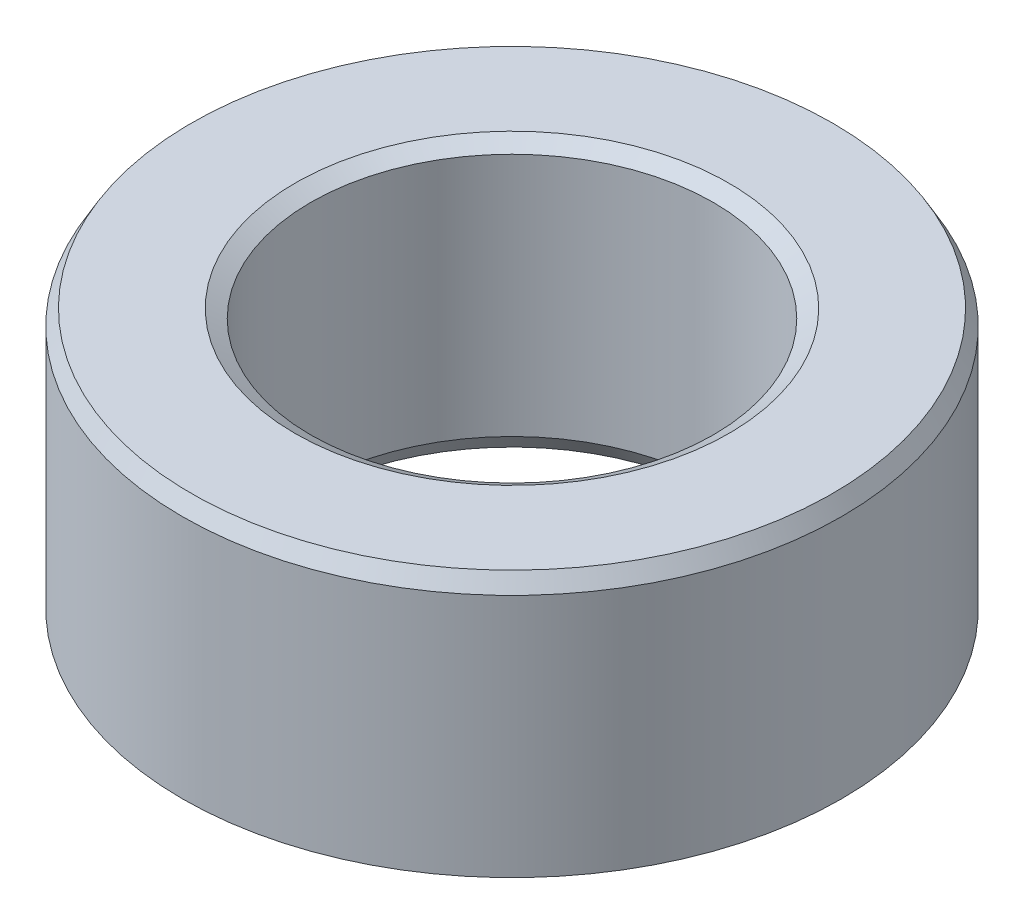
ISO-10303-21;
HEADER;
FILE_DESCRIPTION(('STEP AP214'),'2;1');
FILE_NAME('part.step','',(''),(''),'','','');
FILE_SCHEMA(('AUTOMOTIVE_DESIGN { 1 0 10303 214 1 1 1 1 }'));
ENDSEC;
DATA;
#1=APPLICATION_CONTEXT('core data for automotive mechanical design processes');
#2=APPLICATION_PROTOCOL_DEFINITION('international standard','automotive_design',2000,#1);
#3=PRODUCT_CONTEXT('',#1,'mechanical');
#4=PRODUCT('Part','Part','',(#3));
#5=PRODUCT_RELATED_PRODUCT_CATEGORY('part','',(#4));
#6=PRODUCT_DEFINITION_FORMATION('','',#4);
#7=PRODUCT_DEFINITION_CONTEXT('part definition',#1,'design');
#8=PRODUCT_DEFINITION('design','',#6,#7);
#9=PRODUCT_DEFINITION_SHAPE('','',#8);
#10=(LENGTH_UNIT() NAMED_UNIT(*) SI_UNIT(.MILLI.,.METRE.));
#11=(NAMED_UNIT(*) PLANE_ANGLE_UNIT() SI_UNIT($,.RADIAN.));
#12=(NAMED_UNIT(*) SI_UNIT($,.STERADIAN.) SOLID_ANGLE_UNIT());
#13=UNCERTAINTY_MEASURE_WITH_UNIT(LENGTH_MEASURE(1.E-05),#10,'distance_accuracy_value','');
#14=(GEOMETRIC_REPRESENTATION_CONTEXT(3) GLOBAL_UNCERTAINTY_ASSIGNED_CONTEXT((#13)) GLOBAL_UNIT_ASSIGNED_CONTEXT((#10,
#11,#12)) REPRESENTATION_CONTEXT('',''));
#15=CARTESIAN_POINT('',(0.,0.,0.));
#16=DIRECTION('',(0.,0.,1.));
#17=DIRECTION('',(1.,0.,0.));
#18=AXIS2_PLACEMENT_3D('',#15,#16,#17);
#19=CARTESIAN_POINT('',(0.,46.9005576130169,0.));
#20=DIRECTION('',(0.,-1.,0.));
#21=DIRECTION('',(0.,0.,-1.));
#22=AXIS2_PLACEMENT_3D('',#19,#20,#21);
#23=CYLINDRICAL_SURFACE('',#22,57.5);
#24=CARTESIAN_POINT('',(0.,1.56411601894434,0.));
#25=DIRECTION('',(0.,1.,0.));
#26=DIRECTION('',(0.,0.,1.));
#27=AXIS2_PLACEMENT_3D('',#24,#25,#26);
#28=CIRCLE('',#27,57.5);
#29=CARTESIAN_POINT('',(0.,1.56411601894434,57.5));
#30=VERTEX_POINT('',#29);
#31=EDGE_CURVE('E10',#30,#30,#28,.T.);
#32=ORIENTED_EDGE('',*,*,#31,.T.);
#33=EDGE_LOOP('',(#32));
#34=FACE_BOUND('',#33,.T.);
#35=CARTESIAN_POINT('',(0.,44.191429199273,0.));
#36=DIRECTION('',(0.,1.,0.));
#37=DIRECTION('',(0.,0.,1.));
#38=AXIS2_PLACEMENT_3D('',#35,#36,#37);
#39=CIRCLE('',#38,57.5);
#40=CARTESIAN_POINT('',(0.,44.191429199273,-57.5));
#41=VERTEX_POINT('',#40);
#42=EDGE_CURVE('E50',#41,#41,#39,.F.);
#43=ORIENTED_EDGE('',*,*,#42,.T.);
#44=EDGE_LOOP('',(#43));
#45=FACE_BOUND('',#44,.T.);
#46=ADVANCED_FACE('F39',(#34,#45),#23,.T.);
#47=CARTESIAN_POINT('',(0.,46.9005576130169,0.));
#48=DIRECTION('',(0.,1.,0.));
#49=DIRECTION('',(0.,0.,1.));
#50=AXIS2_PLACEMENT_3D('',#47,#48,#49);
#51=PLANE('',#50);
#52=CARTESIAN_POINT('',(0.,46.9005576130169,0.));
#53=DIRECTION('',(0.,1.,0.));
#54=DIRECTION('',(0.,0.,1.));
#55=AXIS2_PLACEMENT_3D('',#52,#53,#54);
#56=CIRCLE('',#55,37.8292583250053);
#57=CARTESIAN_POINT('',(0.,46.9005576130169,37.8292583250053));
#58=VERTEX_POINT('',#57);
#59=EDGE_CURVE('E58',#58,#58,#56,.F.);
#60=ORIENTED_EDGE('',*,*,#59,.T.);
#61=EDGE_LOOP('',(#60));
#62=FACE_BOUND('',#61,.T.);
#63=CARTESIAN_POINT('',(0.,46.9005576130169,0.));
#64=DIRECTION('',(0.,1.,0.));
#65=DIRECTION('',(0.,0.,1.));
#66=AXIS2_PLACEMENT_3D('',#63,#64,#65);
#67=CIRCLE('',#66,55.9358839810557);
#68=CARTESIAN_POINT('',(0.,46.9005576130169,-55.9358839810557));
#69=VERTEX_POINT('',#68);
#70=EDGE_CURVE('E61',#69,#69,#67,.T.);
#71=ORIENTED_EDGE('',*,*,#70,.T.);
#72=EDGE_LOOP('',(#71));
#73=FACE_BOUND('',#72,.T.);
#74=ADVANCED_FACE('F88',(#62,#73),#51,.T.);
#75=CARTESIAN_POINT('',(0.,0.,0.));
#76=DIRECTION('',(0.,1.,0.));
#77=DIRECTION('',(0.,0.,1.));
#78=AXIS2_PLACEMENT_3D('',#75,#76,#77);
#79=PLANE('',#78);
#80=CARTESIAN_POINT('',(0.,0.,0.));
#81=DIRECTION('',(0.,1.,0.));
#82=DIRECTION('',(0.,0.,1.));
#83=AXIS2_PLACEMENT_3D('',#80,#81,#82);
#84=CIRCLE('',#83,36.6842459302058);
#85=CARTESIAN_POINT('',(0.,0.,36.6842459302058));
#86=VERTEX_POINT('',#85);
#87=EDGE_CURVE('E51',#86,#86,#84,.T.);
#88=ORIENTED_EDGE('',*,*,#87,.T.);
#89=EDGE_LOOP('',(#88));
#90=FACE_BOUND('',#89,.T.);
#91=CARTESIAN_POINT('',(0.,0.,0.));
#92=DIRECTION('',(0.,1.,0.));
#93=DIRECTION('',(0.,0.,1.));
#94=AXIS2_PLACEMENT_3D('',#91,#92,#93);
#95=CIRCLE('',#94,54.790871586256);
#96=CARTESIAN_POINT('',(0.,0.,54.790871586256));
#97=VERTEX_POINT('',#96);
#98=EDGE_CURVE('E54',#97,#97,#95,.F.);
#99=ORIENTED_EDGE('',*,*,#98,.T.);
#100=EDGE_LOOP('',(#99));
#101=FACE_BOUND('',#100,.T.);
#102=ADVANCED_FACE('F83',(#90,#101),#79,.F.);
#103=CARTESIAN_POINT('',(0.,46.9005576130169,0.));
#104=DIRECTION('',(0.,-1.,0.));
#105=DIRECTION('',(0.,0.,-1.));
#106=AXIS2_PLACEMENT_3D('',#103,#104,#105);
#107=CYLINDRICAL_SURFACE('',#106,35.1201299112614);
#108=CARTESIAN_POINT('',(0.,45.3364415940726,0.));
#109=DIRECTION('',(0.,1.,0.));
#110=DIRECTION('',(0.,0.,1.));
#111=AXIS2_PLACEMENT_3D('',#108,#109,#110);
#112=CIRCLE('',#111,35.1201299112614);
#113=CARTESIAN_POINT('',(0.,45.3364415940726,35.1201299112614));
#114=VERTEX_POINT('',#113);
#115=EDGE_CURVE('E67',#114,#114,#112,.T.);
#116=ORIENTED_EDGE('',*,*,#115,.T.);
#117=EDGE_LOOP('',(#116));
#118=FACE_BOUND('',#117,.T.);
#119=CARTESIAN_POINT('',(0.,2.70912841374395,0.));
#120=DIRECTION('',(0.,1.,0.));
#121=DIRECTION('',(0.,0.,1.));
#122=AXIS2_PLACEMENT_3D('',#119,#120,#121);
#123=CIRCLE('',#122,35.1201299112614);
#124=CARTESIAN_POINT('',(0.,2.70912841374395,35.1201299112614));
#125=VERTEX_POINT('',#124);
#126=EDGE_CURVE('E69',#125,#125,#123,.F.);
#127=ORIENTED_EDGE('',*,*,#126,.T.);
#128=EDGE_LOOP('',(#127));
#129=FACE_BOUND('',#128,.T.);
#130=ADVANCED_FACE('F71',(#118,#129),#107,.F.);
#131=CARTESIAN_POINT('',(0.,45.3364415940726,0.));
#132=DIRECTION('',(0.,1.,0.));
#133=DIRECTION('',(0.,0.,1.));
#134=AXIS2_PLACEMENT_3D('',#131,#132,#133);
#135=CONICAL_SURFACE('',#134,35.1201299112614,1.0471975511966);
#136=ORIENTED_EDGE('',*,*,#59,.F.);
#137=EDGE_LOOP('',(#136));
#138=FACE_BOUND('',#137,.T.);
#139=ORIENTED_EDGE('',*,*,#115,.F.);
#140=EDGE_LOOP('',(#139));
#141=FACE_BOUND('',#140,.T.);
#142=ADVANCED_FACE('F77',(#138,#141),#135,.F.);
#143=CARTESIAN_POINT('',(0.,0.,0.));
#144=DIRECTION('',(0.,-1.,0.));
#145=DIRECTION('',(0.,0.,-1.));
#146=AXIS2_PLACEMENT_3D('',#143,#144,#145);
#147=CONICAL_SURFACE('',#146,36.6842459302058,0.523598775598297);
#148=ORIENTED_EDGE('',*,*,#126,.F.);
#149=EDGE_LOOP('',(#148));
#150=FACE_BOUND('',#149,.T.);
#151=ORIENTED_EDGE('',*,*,#87,.F.);
#152=EDGE_LOOP('',(#151));
#153=FACE_BOUND('',#152,.T.);
#154=ADVANCED_FACE('F73',(#150,#153),#147,.F.);
#155=CARTESIAN_POINT('',(0.,1.56411601894434,0.));
#156=DIRECTION('',(0.,1.,0.));
#157=DIRECTION('',(0.,0.,1.));
#158=AXIS2_PLACEMENT_3D('',#155,#156,#157);
#159=CONICAL_SURFACE('',#158,57.5,1.0471975511966);
#160=ORIENTED_EDGE('',*,*,#98,.F.);
#161=EDGE_LOOP('',(#160));
#162=FACE_BOUND('',#161,.T.);
#163=ORIENTED_EDGE('',*,*,#31,.F.);
#164=EDGE_LOOP('',(#163));
#165=FACE_BOUND('',#164,.T.);
#166=ADVANCED_FACE('F76',(#162,#165),#159,.T.);
#167=CARTESIAN_POINT('',(0.,46.9005576130169,0.));
#168=DIRECTION('',(0.,-1.,0.));
#169=DIRECTION('',(0.,0.,-1.));
#170=AXIS2_PLACEMENT_3D('',#167,#168,#169);
#171=CONICAL_SURFACE('',#170,55.9358839810557,0.523598775598295);
#172=CARTESIAN_POINT('',(0.,44.191429199273,-57.5));
#173=CARTESIAN_POINT('',(0.,44.2196492869162,-57.4837071248027));
#174=CARTESIAN_POINT('',(0.,44.2478693745594,-57.4674142496053));
#175=CARTESIAN_POINT('',(0.,44.3043095498457,-57.4348284992107));
#176=CARTESIAN_POINT('',(0.,44.3325296374888,-57.4185356240133));
#177=CARTESIAN_POINT('',(0.,44.3889698127752,-57.3859498736186));
#178=CARTESIAN_POINT('',(0.,44.4171899004183,-57.3696569984213));
#179=CARTESIAN_POINT('',(0.,44.4736300757047,-57.3370712480266));
#180=CARTESIAN_POINT('',(0.,44.5018501633478,-57.3207783728293));
#181=CARTESIAN_POINT('',(0.,44.5582903386342,-57.2881926224346));
#182=CARTESIAN_POINT('',(0.,44.5865104262773,-57.2718997472373));
#183=CARTESIAN_POINT('',(0.,44.6429506015637,-57.2393139968426));
#184=CARTESIAN_POINT('',(0.,44.6711706892068,-57.2230211216453));
#185=CARTESIAN_POINT('',(0.,44.7276108644932,-57.1904353712506));
#186=CARTESIAN_POINT('',(0.,44.7558309521363,-57.1741424960533));
#187=CARTESIAN_POINT('',(0.,44.8122711274227,-57.1415567456586));
#188=CARTESIAN_POINT('',(0.,44.8404912150658,-57.1252638704613));
#189=CARTESIAN_POINT('',(0.,44.8969313903522,-57.0926781200666));
#190=CARTESIAN_POINT('',(0.,44.9251514779953,-57.0763852448693));
#191=CARTESIAN_POINT('',(0.,44.9815916532816,-57.0437994944746));
#192=CARTESIAN_POINT('',(0.,45.0098117409248,-57.0275066192773));
#193=CARTESIAN_POINT('',(0.,45.0662519162111,-56.9949208688826));
#194=CARTESIAN_POINT('',(0.,45.0944720038543,-56.9786279936853));
#195=CARTESIAN_POINT('',(0.,45.1509121791406,-56.9460422432906));
#196=CARTESIAN_POINT('',(0.,45.1791322667838,-56.9297493680932));
#197=CARTESIAN_POINT('',(0.,45.2355724420701,-56.8971636176986));
#198=CARTESIAN_POINT('',(0.,45.2637925297133,-56.8808707425012));
#199=CARTESIAN_POINT('',(0.,45.3202327049996,-56.8482849921066));
#200=CARTESIAN_POINT('',(0.,45.3484527926428,-56.8319921169092));
#201=CARTESIAN_POINT('',(0.,45.4048929679291,-56.7994063665146));
#202=CARTESIAN_POINT('',(0.,45.4331130555723,-56.7831134913172));
#203=CARTESIAN_POINT('',(0.,45.4895532308586,-56.7505277409225));
#204=CARTESIAN_POINT('',(0.,45.5177733185018,-56.7342348657252));
#205=CARTESIAN_POINT('',(0.,45.5742134937881,-56.7016491153305));
#206=CARTESIAN_POINT('',(0.,45.6024335814313,-56.6853562401332));
#207=CARTESIAN_POINT('',(0.,45.6588737567176,-56.6527704897385));
#208=CARTESIAN_POINT('',(0.,45.6870938443608,-56.6364776145412));
#209=CARTESIAN_POINT('',(0.,45.7435340196471,-56.6038918641465));
#210=CARTESIAN_POINT('',(0.,45.7717541072903,-56.5875989889492));
#211=CARTESIAN_POINT('',(0.,45.8281942825766,-56.5550132385545));
#212=CARTESIAN_POINT('',(0.,45.8564143702198,-56.5387203633572));
#213=CARTESIAN_POINT('',(0.,45.9128545455061,-56.5061346129625));
#214=CARTESIAN_POINT('',(0.,45.9410746331493,-56.4898417377652));
#215=CARTESIAN_POINT('',(0.,45.9975148084356,-56.4572559873705));
#216=CARTESIAN_POINT('',(0.,46.0257348960788,-56.4409631121732));
#217=CARTESIAN_POINT('',(0.,46.0821750713651,-56.4083773617785));
#218=CARTESIAN_POINT('',(0.,46.1103951590082,-56.3920844865812));
#219=CARTESIAN_POINT('',(0.,46.1668353342946,-56.3594987361865));
#220=CARTESIAN_POINT('',(0.,46.1950554219377,-56.3432058609892));
#221=CARTESIAN_POINT('',(0.,46.2514955972241,-56.3106201105945));
#222=CARTESIAN_POINT('',(0.,46.2797156848672,-56.2943272353971));
#223=CARTESIAN_POINT('',(0.,46.3361558601536,-56.2617414850025));
#224=CARTESIAN_POINT('',(0.,46.3643759477967,-56.2454486098051));
#225=CARTESIAN_POINT('',(0.,46.4208161230831,-56.2128628594105));
#226=CARTESIAN_POINT('',(0.,46.4490362107262,-56.1965699842131));
#227=CARTESIAN_POINT('',(0.,46.5054763860126,-56.1639842338184));
#228=CARTESIAN_POINT('',(0.,46.5336964736557,-56.1476913586211));
#229=CARTESIAN_POINT('',(0.,46.5901366489421,-56.1151056082265));
#230=CARTESIAN_POINT('',(0.,46.6183567365852,-56.0988127330291));
#231=CARTESIAN_POINT('',(0.,46.6747969118716,-56.0662269826344));
#232=CARTESIAN_POINT('',(0.,46.7030169995147,-56.0499341074371));
#233=CARTESIAN_POINT('',(0.,46.759457174801,-56.0173483570424));
#234=CARTESIAN_POINT('',(0.,46.7876772624442,-56.0010554818451));
#235=CARTESIAN_POINT('',(0.,46.8441174377305,-55.9684697314504));
#236=CARTESIAN_POINT('',(0.,46.8723375253737,-55.9521768562531));
#237=CARTESIAN_POINT('',(0.,46.9005576130169,-55.9358839810557));
#238=B_SPLINE_CURVE_WITH_KNOTS('',3,(#172,#173,#174,#175,#176,#177,#178,#179,#180,#181,#182,
#183,#184,#185,#186,#187,#188,#189,#190,#191,#192,#193,#194,#195,#196,#197,#198,#199,#200,#201,
#202,#203,#204,#205,#206,#207,#208,#209,#210,#211,#212,#213,#214,#215,#216,#217,#218,#219,#220,
#221,#222,#223,#224,#225,#226,#227,#228,#229,#230,#231,#232,#233,#234,#235,#236,#237),
.UNSPECIFIED.,.F.,.F.,(4,2,2,2,2,2,2,2,2,2,2,2,2,2,2,2,2,2,2,2,2,2,2,2,2,2,2,2,2,2,2,2,4),(0.,
0.0977572511840112,0.195514502368032,0.293271753552046,0.391029004736064,0.488786255920084,
0.586543507104095,0.684300758288116,0.782058009472133,0.879815260656148,0.977572511840168,
1.07532976302418,1.1730870142082,1.27084426539222,1.36860151657623,1.46635876776025,
1.56411601894427,1.66187327012828,1.7596305213123,1.85738777249632,1.95514502368034,
2.05290227486435,2.15065952604837,2.24841677723239,2.34617402841641,2.44393127960042,
2.54168853078444,2.63944578196845,2.73720303315247,2.83496028433649,2.9327175355205,
3.03047478670452,3.12823203788854),.UNSPECIFIED.);
#239=EDGE_CURVE('BSEAM45',#41,#69,#238,.T.);
#240=ORIENTED_EDGE('',*,*,#42,.F.);
#241=ORIENTED_EDGE('',*,*,#70,.F.);
#242=ORIENTED_EDGE('',*,*,#239,.T.);
#243=ORIENTED_EDGE('',*,*,#239,.F.);
#244=EDGE_LOOP('',(#240,#242,#241,#243));
#245=FACE_BOUND('',#244,.T.);
#246=ADVANCED_FACE('F45',(#245),#171,.T.);
#247=CLOSED_SHELL('',(#46,#74,#102,#130,#142,#154,#166,#246));
#248=MANIFOLD_SOLID_BREP('B2',#247);
#249=ADVANCED_BREP_SHAPE_REPRESENTATION('',(#18,#248),#14);
#250=SHAPE_DEFINITION_REPRESENTATION(#9,#249);
ENDSEC;
END-ISO-10303-21;
